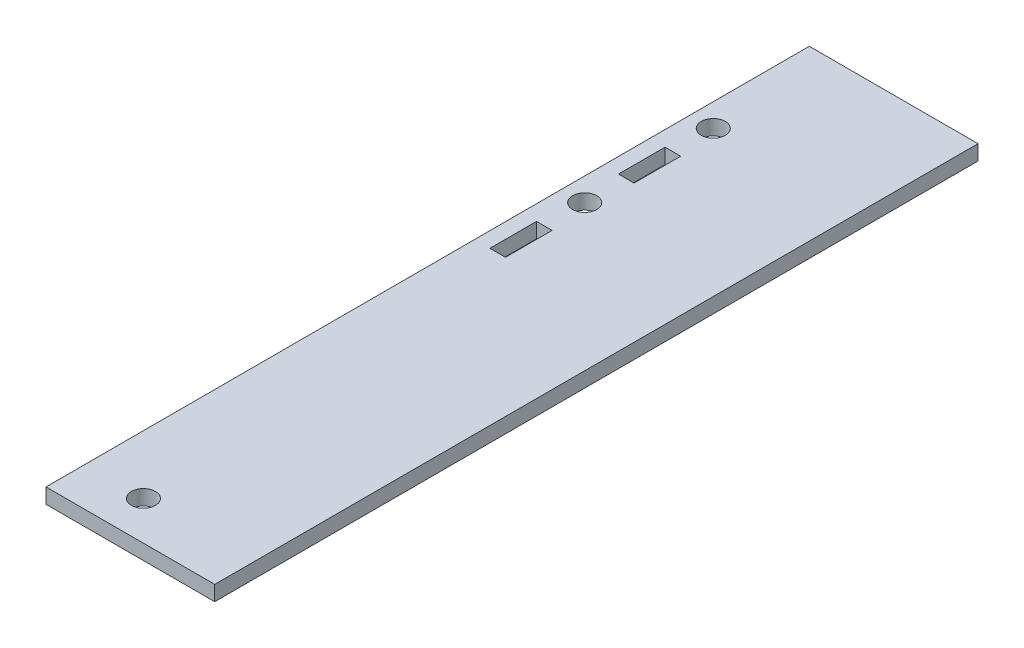
ISO-10303-21;
HEADER;
FILE_DESCRIPTION(('STEP AP214'),'2;1');
FILE_NAME('part.step','',(''),(''),'','','');
FILE_SCHEMA(('AUTOMOTIVE_DESIGN { 1 0 10303 214 1 1 1 1 }'));
ENDSEC;
DATA;
#1=APPLICATION_CONTEXT('core data for automotive mechanical design processes');
#2=APPLICATION_PROTOCOL_DEFINITION('international standard','automotive_design',2000,#1);
#3=PRODUCT_CONTEXT('',#1,'mechanical');
#4=PRODUCT('Part','Part','',(#3));
#5=PRODUCT_RELATED_PRODUCT_CATEGORY('part','',(#4));
#6=PRODUCT_DEFINITION_FORMATION('','',#4);
#7=PRODUCT_DEFINITION_CONTEXT('part definition',#1,'design');
#8=PRODUCT_DEFINITION('design','',#6,#7);
#9=PRODUCT_DEFINITION_SHAPE('','',#8);
#10=(LENGTH_UNIT() NAMED_UNIT(*) SI_UNIT(.MILLI.,.METRE.));
#11=(NAMED_UNIT(*) PLANE_ANGLE_UNIT() SI_UNIT($,.RADIAN.));
#12=(NAMED_UNIT(*) SI_UNIT($,.STERADIAN.) SOLID_ANGLE_UNIT());
#13=UNCERTAINTY_MEASURE_WITH_UNIT(LENGTH_MEASURE(1.E-05),#10,'distance_accuracy_value','');
#14=(GEOMETRIC_REPRESENTATION_CONTEXT(3) GLOBAL_UNCERTAINTY_ASSIGNED_CONTEXT((#13)) GLOBAL_UNIT_ASSIGNED_CONTEXT((#10,
#11,#12)) REPRESENTATION_CONTEXT('',''));
#15=CARTESIAN_POINT('',(0.,0.,0.));
#16=DIRECTION('',(0.,0.,1.));
#17=DIRECTION('',(1.,0.,0.));
#18=AXIS2_PLACEMENT_3D('',#15,#16,#17);
#19=CARTESIAN_POINT('',(19.05,0.,120.65));
#20=DIRECTION('',(0.,1.,0.));
#21=DIRECTION('',(-1.,0.,0.));
#22=AXIS2_PLACEMENT_3D('',#19,#20,#21);
#23=PLANE('',#22);
#24=CARTESIAN_POINT('',(15.08125,0.,18.82775));
#25=DIRECTION('',(0.,1.,0.));
#26=DIRECTION('',(-1.,0.,0.));
#27=AXIS2_PLACEMENT_3D('',#24,#25,#26);
#28=CIRCLE('',#27,1.905);
#29=CARTESIAN_POINT('',(13.17625,0.,18.82775));
#30=VERTEX_POINT('',#29);
#31=EDGE_CURVE('E287',#30,#30,#28,.T.);
#32=ORIENTED_EDGE('',*,*,#31,.T.);
#33=EDGE_LOOP('',(#32));
#34=FACE_BOUND('',#33,.T.);
#35=DIRECTION('',(0.,0.,1.));
#36=VECTOR('',#35,1.);
#37=CARTESIAN_POINT('',(16.317595,0.,120.65));
#38=LINE('',#37,#36);
#39=CARTESIAN_POINT('',(16.317595,0.,45.5295));
#40=VERTEX_POINT('',#39);
#41=CARTESIAN_POINT('',(16.317595,0.,52.8955));
#42=VERTEX_POINT('',#41);
#43=EDGE_CURVE('E268',#40,#42,#38,.T.);
#44=ORIENTED_EDGE('',*,*,#43,.F.);
#45=DIRECTION('',(1.,0.,0.));
#46=VECTOR('',#45,1.);
#47=CARTESIAN_POINT('',(19.05,0.,45.5295));
#48=LINE('',#47,#46);
#49=CARTESIAN_POINT('',(13.844905,0.,45.5295));
#50=VERTEX_POINT('',#49);
#51=EDGE_CURVE('E201',#50,#40,#48,.T.);
#52=ORIENTED_EDGE('',*,*,#51,.F.);
#53=DIRECTION('',(0.,0.,-1.));
#54=VECTOR('',#53,1.);
#55=CARTESIAN_POINT('',(13.844905,0.,120.65));
#56=LINE('',#55,#54);
#57=CARTESIAN_POINT('',(13.844905,0.,52.8955));
#58=VERTEX_POINT('',#57);
#59=EDGE_CURVE('E260',#58,#50,#56,.T.);
#60=ORIENTED_EDGE('',*,*,#59,.F.);
#61=DIRECTION('',(1.,0.,0.));
#62=VECTOR('',#61,1.);
#63=CARTESIAN_POINT('',(19.05,0.,52.8955));
#64=LINE('',#63,#62);
#65=EDGE_CURVE('E264',#58,#42,#64,.T.);
#66=ORIENTED_EDGE('',*,*,#65,.T.);
#67=EDGE_LOOP('',(#44,#52,#60,#66));
#68=FACE_BOUND('',#67,.T.);
#69=CARTESIAN_POINT('',(20.701,0.,114.5159));
#70=DIRECTION('',(0.,1.,0.));
#71=DIRECTION('',(0.,0.,1.));
#72=AXIS2_PLACEMENT_3D('',#69,#70,#71);
#73=CIRCLE('',#72,1.905);
#74=CARTESIAN_POINT('',(20.701,0.,116.4209));
#75=VERTEX_POINT('',#74);
#76=EDGE_CURVE('E168',#75,#75,#73,.T.);
#77=ORIENTED_EDGE('',*,*,#76,.T.);
#78=EDGE_LOOP('',(#77));
#79=FACE_BOUND('',#78,.T.);
#80=DIRECTION('',(0.,0.,-1.));
#81=VECTOR('',#80,1.);
#82=CARTESIAN_POINT('',(11.43,0.,120.65));
#83=LINE('',#82,#81);
#84=CARTESIAN_POINT('',(11.43,0.,120.65));
#85=VERTEX_POINT('',#84);
#86=CARTESIAN_POINT('',(11.43,0.,0.));
#87=VERTEX_POINT('',#86);
#88=EDGE_CURVE('E153',#85,#87,#83,.T.);
#89=ORIENTED_EDGE('',*,*,#88,.T.);
#90=DIRECTION('',(1.,0.,0.));
#91=VECTOR('',#90,1.);
#92=CARTESIAN_POINT('',(11.43,0.,0.));
#93=LINE('',#92,#91);
#94=CARTESIAN_POINT('',(38.1,0.,0.));
#95=VERTEX_POINT('',#94);
#96=EDGE_CURVE('E64',#87,#95,#93,.T.);
#97=ORIENTED_EDGE('',*,*,#96,.T.);
#98=DIRECTION('',(0.,0.,1.));
#99=VECTOR('',#98,1.);
#100=CARTESIAN_POINT('',(38.1,0.,0.));
#101=LINE('',#100,#99);
#102=CARTESIAN_POINT('',(38.1,0.,120.65));
#103=VERTEX_POINT('',#102);
#104=EDGE_CURVE('E151',#95,#103,#101,.T.);
#105=ORIENTED_EDGE('',*,*,#104,.T.);
#106=DIRECTION('',(1.,0.,0.));
#107=VECTOR('',#106,1.);
#108=CARTESIAN_POINT('',(19.05,0.,120.65));
#109=LINE('',#108,#107);
#110=EDGE_CURVE('E57',#85,#103,#109,.T.);
#111=ORIENTED_EDGE('',*,*,#110,.F.);
#112=EDGE_LOOP('',(#89,#97,#105,#111));
#113=FACE_BOUND('',#112,.T.);
#114=CARTESIAN_POINT('',(15.08125,0.,39.14775));
#115=DIRECTION('',(0.,1.,0.));
#116=DIRECTION('',(-1.,0.,0.));
#117=AXIS2_PLACEMENT_3D('',#114,#115,#116);
#118=CIRCLE('',#117,1.905);
#119=CARTESIAN_POINT('',(13.17625,0.,39.14775));
#120=VERTEX_POINT('',#119);
#121=EDGE_CURVE('E271',#120,#120,#118,.T.);
#122=ORIENTED_EDGE('',*,*,#121,.T.);
#123=EDGE_LOOP('',(#122));
#124=FACE_BOUND('',#123,.T.);
#125=DIRECTION('',(0.,0.,1.));
#126=VECTOR('',#125,1.);
#127=CARTESIAN_POINT('',(16.317595,0.,120.65));
#128=LINE('',#127,#126);
#129=CARTESIAN_POINT('',(16.317595,0.,25.2095));
#130=VERTEX_POINT('',#129);
#131=CARTESIAN_POINT('',(16.317595,0.,32.5755));
#132=VERTEX_POINT('',#131);
#133=EDGE_CURVE('E284',#130,#132,#128,.T.);
#134=ORIENTED_EDGE('',*,*,#133,.F.);
#135=DIRECTION('',(1.,0.,0.));
#136=VECTOR('',#135,1.);
#137=CARTESIAN_POINT('',(19.05,0.,25.2095));
#138=LINE('',#137,#136);
#139=CARTESIAN_POINT('',(13.844905,0.,25.2095));
#140=VERTEX_POINT('',#139);
#141=EDGE_CURVE('E275',#140,#130,#138,.T.);
#142=ORIENTED_EDGE('',*,*,#141,.F.);
#143=DIRECTION('',(0.,0.,-1.));
#144=VECTOR('',#143,1.);
#145=CARTESIAN_POINT('',(13.844905,0.,120.65));
#146=LINE('',#145,#144);
#147=CARTESIAN_POINT('',(13.844905,0.,32.5755));
#148=VERTEX_POINT('',#147);
#149=EDGE_CURVE('E278',#148,#140,#146,.T.);
#150=ORIENTED_EDGE('',*,*,#149,.F.);
#151=DIRECTION('',(-1.,0.,0.));
#152=VECTOR('',#151,1.);
#153=CARTESIAN_POINT('',(19.05,0.,32.5755));
#154=LINE('',#153,#152);
#155=EDGE_CURVE('E281',#132,#148,#154,.T.);
#156=ORIENTED_EDGE('',*,*,#155,.F.);
#157=EDGE_LOOP('',(#134,#142,#150,#156));
#158=FACE_BOUND('',#157,.T.);
#159=ADVANCED_FACE('F49',(#34,#68,#79,#113,#124,#158),#23,.F.);
#160=CARTESIAN_POINT('',(0.,2.38125,120.65));
#161=DIRECTION('',(0.,-1.,0.));
#162=DIRECTION('',(0.,0.,-1.));
#163=AXIS2_PLACEMENT_3D('',#160,#161,#162);
#164=PLANE('',#163);
#165=CARTESIAN_POINT('',(15.08125,2.38125,18.82775));
#166=DIRECTION('',(0.,1.,0.));
#167=DIRECTION('',(0.,0.,1.));
#168=AXIS2_PLACEMENT_3D('',#165,#166,#167);
#169=CIRCLE('',#168,1.905);
#170=CARTESIAN_POINT('',(15.08125,2.38125,20.73275));
#171=VERTEX_POINT('',#170);
#172=EDGE_CURVE('E197',#171,#171,#169,.T.);
#173=ORIENTED_EDGE('',*,*,#172,.F.);
#174=EDGE_LOOP('',(#173));
#175=FACE_BOUND('',#174,.T.);
#176=DIRECTION('',(0.,0.,1.));
#177=VECTOR('',#176,1.);
#178=CARTESIAN_POINT('',(16.317595,2.38125,0.));
#179=LINE('',#178,#177);
#180=CARTESIAN_POINT('',(16.317595,2.38125,45.5295));
#181=VERTEX_POINT('',#180);
#182=CARTESIAN_POINT('',(16.317595,2.38125,52.8955));
#183=VERTEX_POINT('',#182);
#184=EDGE_CURVE('E185',#181,#183,#179,.T.);
#185=ORIENTED_EDGE('',*,*,#184,.T.);
#186=DIRECTION('',(1.,0.,0.));
#187=VECTOR('',#186,1.);
#188=CARTESIAN_POINT('',(0.,2.38125,52.8955));
#189=LINE('',#188,#187);
#190=CARTESIAN_POINT('',(13.844905,2.38125,52.8955));
#191=VERTEX_POINT('',#190);
#192=EDGE_CURVE('E242',#191,#183,#189,.T.);
#193=ORIENTED_EDGE('',*,*,#192,.F.);
#194=DIRECTION('',(0.,0.,-1.));
#195=VECTOR('',#194,1.);
#196=CARTESIAN_POINT('',(13.844905,2.38125,0.));
#197=LINE('',#196,#195);
#198=CARTESIAN_POINT('',(13.844905,2.38125,45.5295));
#199=VERTEX_POINT('',#198);
#200=EDGE_CURVE('E238',#191,#199,#197,.T.);
#201=ORIENTED_EDGE('',*,*,#200,.T.);
#202=DIRECTION('',(1.,0.,0.));
#203=VECTOR('',#202,1.);
#204=CARTESIAN_POINT('',(0.,2.38125,45.5295));
#205=LINE('',#204,#203);
#206=EDGE_CURVE('E192',#199,#181,#205,.T.);
#207=ORIENTED_EDGE('',*,*,#206,.T.);
#208=EDGE_LOOP('',(#185,#193,#201,#207));
#209=FACE_BOUND('',#208,.T.);
#210=CARTESIAN_POINT('',(20.701,2.38125,114.5159));
#211=DIRECTION('',(0.,1.,0.));
#212=DIRECTION('',(0.,0.,1.));
#213=AXIS2_PLACEMENT_3D('',#210,#211,#212);
#214=CIRCLE('',#213,1.905);
#215=CARTESIAN_POINT('',(20.701,2.38125,116.4209));
#216=VERTEX_POINT('',#215);
#217=EDGE_CURVE('E171',#216,#216,#214,.T.);
#218=ORIENTED_EDGE('',*,*,#217,.F.);
#219=EDGE_LOOP('',(#218));
#220=FACE_BOUND('',#219,.T.);
#221=DIRECTION('',(0.,0.,1.));
#222=VECTOR('',#221,1.);
#223=CARTESIAN_POINT('',(38.1,2.38125,0.));
#224=LINE('',#223,#222);
#225=CARTESIAN_POINT('',(38.1,2.38125,0.));
#226=VERTEX_POINT('',#225);
#227=CARTESIAN_POINT('',(38.1,2.38125,120.65));
#228=VERTEX_POINT('',#227);
#229=EDGE_CURVE('E161',#226,#228,#224,.T.);
#230=ORIENTED_EDGE('',*,*,#229,.F.);
#231=DIRECTION('',(1.,0.,0.));
#232=VECTOR('',#231,1.);
#233=CARTESIAN_POINT('',(11.43,2.38125,0.));
#234=LINE('',#233,#232);
#235=CARTESIAN_POINT('',(11.43,2.38125,0.));
#236=VERTEX_POINT('',#235);
#237=EDGE_CURVE('E139',#236,#226,#234,.T.);
#238=ORIENTED_EDGE('',*,*,#237,.F.);
#239=DIRECTION('',(0.,0.,-1.));
#240=VECTOR('',#239,1.);
#241=CARTESIAN_POINT('',(11.43,2.38125,120.65));
#242=LINE('',#241,#240);
#243=CARTESIAN_POINT('',(11.43,2.38125,120.65));
#244=VERTEX_POINT('',#243);
#245=EDGE_CURVE('E144',#244,#236,#242,.T.);
#246=ORIENTED_EDGE('',*,*,#245,.F.);
#247=DIRECTION('',(-1.,0.,0.));
#248=VECTOR('',#247,1.);
#249=CARTESIAN_POINT('',(0.,2.38125,120.65));
#250=LINE('',#249,#248);
#251=EDGE_CURVE('E11',#228,#244,#250,.T.);
#252=ORIENTED_EDGE('',*,*,#251,.F.);
#253=EDGE_LOOP('',(#230,#238,#246,#252));
#254=FACE_BOUND('',#253,.T.);
#255=CARTESIAN_POINT('',(15.08125,2.38125,39.14775));
#256=DIRECTION('',(0.,1.,0.));
#257=DIRECTION('',(0.,0.,1.));
#258=AXIS2_PLACEMENT_3D('',#255,#256,#257);
#259=CIRCLE('',#258,1.905);
#260=CARTESIAN_POINT('',(15.08125,2.38125,41.05275));
#261=VERTEX_POINT('',#260);
#262=EDGE_CURVE('E208',#261,#261,#259,.T.);
#263=ORIENTED_EDGE('',*,*,#262,.F.);
#264=EDGE_LOOP('',(#263));
#265=FACE_BOUND('',#264,.T.);
#266=DIRECTION('',(0.,0.,1.));
#267=VECTOR('',#266,1.);
#268=CARTESIAN_POINT('',(16.317595,2.38125,0.));
#269=LINE('',#268,#267);
#270=CARTESIAN_POINT('',(16.317595,2.38125,25.2095));
#271=VERTEX_POINT('',#270);
#272=CARTESIAN_POINT('',(16.317595,2.38125,32.5755));
#273=VERTEX_POINT('',#272);
#274=EDGE_CURVE('E203',#271,#273,#269,.T.);
#275=ORIENTED_EDGE('',*,*,#274,.T.);
#276=DIRECTION('',(-1.,0.,0.));
#277=VECTOR('',#276,1.);
#278=CARTESIAN_POINT('',(0.,2.38125,32.5755));
#279=LINE('',#278,#277);
#280=CARTESIAN_POINT('',(13.844905,2.38125,32.5755));
#281=VERTEX_POINT('',#280);
#282=EDGE_CURVE('E216',#273,#281,#279,.T.);
#283=ORIENTED_EDGE('',*,*,#282,.T.);
#284=DIRECTION('',(0.,0.,-1.));
#285=VECTOR('',#284,1.);
#286=CARTESIAN_POINT('',(13.844905,2.38125,0.));
#287=LINE('',#286,#285);
#288=CARTESIAN_POINT('',(13.844905,2.38125,25.2095));
#289=VERTEX_POINT('',#288);
#290=EDGE_CURVE('E212',#281,#289,#287,.T.);
#291=ORIENTED_EDGE('',*,*,#290,.T.);
#292=DIRECTION('',(1.,0.,0.));
#293=VECTOR('',#292,1.);
#294=CARTESIAN_POINT('',(0.,2.38125,25.2095));
#295=LINE('',#294,#293);
#296=EDGE_CURVE('E207',#289,#271,#295,.T.);
#297=ORIENTED_EDGE('',*,*,#296,.T.);
#298=EDGE_LOOP('',(#275,#283,#291,#297));
#299=FACE_BOUND('',#298,.T.);
#300=ADVANCED_FACE('F304',(#175,#209,#220,#254,#265,#299),#164,.F.);
#301=CARTESIAN_POINT('',(0.,0.,120.65));
#302=DIRECTION('',(0.,0.,-1.));
#303=DIRECTION('',(-1.,0.,0.));
#304=AXIS2_PLACEMENT_3D('',#301,#302,#303);
#305=PLANE('',#304);
#306=ORIENTED_EDGE('',*,*,#251,.T.);
#307=DIRECTION('',(0.,1.,0.));
#308=VECTOR('',#307,1.);
#309=CARTESIAN_POINT('',(11.43,0.,120.65));
#310=LINE('',#309,#308);
#311=EDGE_CURVE('E179',#85,#244,#310,.T.);
#312=ORIENTED_EDGE('',*,*,#311,.F.);
#313=ORIENTED_EDGE('',*,*,#110,.T.);
#314=DIRECTION('',(0.,1.,0.));
#315=VECTOR('',#314,1.);
#316=CARTESIAN_POINT('',(38.1,0.,120.65));
#317=LINE('',#316,#315);
#318=EDGE_CURVE('E159',#103,#228,#317,.T.);
#319=ORIENTED_EDGE('',*,*,#318,.T.);
#320=EDGE_LOOP('',(#306,#312,#313,#319));
#321=FACE_BOUND('',#320,.T.);
#322=ADVANCED_FACE('F178',(#321),#305,.F.);
#323=CARTESIAN_POINT('',(38.1,0.,0.));
#324=DIRECTION('',(-1.,0.,0.));
#325=DIRECTION('',(0.,0.,1.));
#326=AXIS2_PLACEMENT_3D('',#323,#324,#325);
#327=PLANE('',#326);
#328=ORIENTED_EDGE('',*,*,#104,.F.);
#329=DIRECTION('',(0.,1.,0.));
#330=VECTOR('',#329,1.);
#331=CARTESIAN_POINT('',(38.1,0.,0.));
#332=LINE('',#331,#330);
#333=EDGE_CURVE('E136',#95,#226,#332,.T.);
#334=ORIENTED_EDGE('',*,*,#333,.T.);
#335=ORIENTED_EDGE('',*,*,#229,.T.);
#336=ORIENTED_EDGE('',*,*,#318,.F.);
#337=EDGE_LOOP('',(#328,#334,#335,#336));
#338=FACE_BOUND('',#337,.T.);
#339=ADVANCED_FACE('F157',(#338),#327,.F.);
#340=CARTESIAN_POINT('',(20.701,0.,114.5159));
#341=DIRECTION('',(0.,1.,0.));
#342=DIRECTION('',(0.,0.,1.));
#343=AXIS2_PLACEMENT_3D('',#340,#341,#342);
#344=CYLINDRICAL_SURFACE('',#343,1.905);
#345=ORIENTED_EDGE('',*,*,#76,.F.);
#346=EDGE_LOOP('',(#345));
#347=FACE_BOUND('',#346,.T.);
#348=ORIENTED_EDGE('',*,*,#217,.T.);
#349=EDGE_LOOP('',(#348));
#350=FACE_BOUND('',#349,.T.);
#351=ADVANCED_FACE('F302',(#347,#350),#344,.F.);
#352=CARTESIAN_POINT('',(16.317595,-0.15875,0.));
#353=DIRECTION('',(-1.,0.,0.));
#354=DIRECTION('',(0.,0.,1.));
#355=AXIS2_PLACEMENT_3D('',#352,#353,#354);
#356=PLANE('',#355);
#357=ORIENTED_EDGE('',*,*,#43,.T.);
#358=DIRECTION('',(0.,1.,0.));
#359=VECTOR('',#358,1.);
#360=CARTESIAN_POINT('',(16.317595,-0.15875,52.8955));
#361=LINE('',#360,#359);
#362=EDGE_CURVE('E233',#42,#183,#361,.T.);
#363=ORIENTED_EDGE('',*,*,#362,.T.);
#364=ORIENTED_EDGE('',*,*,#184,.F.);
#365=DIRECTION('',(0.,1.,0.));
#366=VECTOR('',#365,1.);
#367=CARTESIAN_POINT('',(16.317595,-0.15875,45.5295));
#368=LINE('',#367,#366);
#369=EDGE_CURVE('E246',#40,#181,#368,.T.);
#370=ORIENTED_EDGE('',*,*,#369,.F.);
#371=EDGE_LOOP('',(#357,#363,#364,#370));
#372=FACE_BOUND('',#371,.T.);
#373=ADVANCED_FACE('F350',(#372),#356,.T.);
#374=CARTESIAN_POINT('',(0.,-0.15875,52.8955));
#375=DIRECTION('',(0.,0.,1.));
#376=DIRECTION('',(1.,0.,0.));
#377=AXIS2_PLACEMENT_3D('',#374,#375,#376);
#378=PLANE('',#377);
#379=DIRECTION('',(0.,1.,0.));
#380=VECTOR('',#379,1.);
#381=CARTESIAN_POINT('',(13.844905,-0.15875,52.8955));
#382=LINE('',#381,#380);
#383=EDGE_CURVE('E249',#58,#191,#382,.T.);
#384=ORIENTED_EDGE('',*,*,#383,.T.);
#385=ORIENTED_EDGE('',*,*,#192,.T.);
#386=ORIENTED_EDGE('',*,*,#362,.F.);
#387=ORIENTED_EDGE('',*,*,#65,.F.);
#388=EDGE_LOOP('',(#384,#385,#386,#387));
#389=FACE_BOUND('',#388,.T.);
#390=ADVANCED_FACE('F352',(#389),#378,.F.);
#391=CARTESIAN_POINT('',(13.844905,-0.15875,0.));
#392=DIRECTION('',(1.,0.,0.));
#393=DIRECTION('',(0.,0.,-1.));
#394=AXIS2_PLACEMENT_3D('',#391,#392,#393);
#395=PLANE('',#394);
#396=ORIENTED_EDGE('',*,*,#59,.T.);
#397=DIRECTION('',(0.,1.,0.));
#398=VECTOR('',#397,1.);
#399=CARTESIAN_POINT('',(13.844905,-0.15875,45.5295));
#400=LINE('',#399,#398);
#401=EDGE_CURVE('E252',#50,#199,#400,.T.);
#402=ORIENTED_EDGE('',*,*,#401,.T.);
#403=ORIENTED_EDGE('',*,*,#200,.F.);
#404=ORIENTED_EDGE('',*,*,#383,.F.);
#405=EDGE_LOOP('',(#396,#402,#403,#404));
#406=FACE_BOUND('',#405,.T.);
#407=ADVANCED_FACE('F361',(#406),#395,.T.);
#408=CARTESIAN_POINT('',(0.,-0.15875,45.5295));
#409=DIRECTION('',(0.,0.,1.));
#410=DIRECTION('',(1.,0.,0.));
#411=AXIS2_PLACEMENT_3D('',#408,#409,#410);
#412=PLANE('',#411);
#413=ORIENTED_EDGE('',*,*,#51,.T.);
#414=ORIENTED_EDGE('',*,*,#369,.T.);
#415=ORIENTED_EDGE('',*,*,#206,.F.);
#416=ORIENTED_EDGE('',*,*,#401,.F.);
#417=EDGE_LOOP('',(#413,#414,#415,#416));
#418=FACE_BOUND('',#417,.T.);
#419=ADVANCED_FACE('F359',(#418),#412,.T.);
#420=CARTESIAN_POINT('',(15.08125,-0.15875,39.14775));
#421=DIRECTION('',(0.,1.,0.));
#422=DIRECTION('',(0.,0.,1.));
#423=AXIS2_PLACEMENT_3D('',#420,#421,#422);
#424=CYLINDRICAL_SURFACE('',#423,1.905);
#425=ORIENTED_EDGE('',*,*,#262,.T.);
#426=EDGE_LOOP('',(#425));
#427=FACE_BOUND('',#426,.T.);
#428=ORIENTED_EDGE('',*,*,#121,.F.);
#429=EDGE_LOOP('',(#428));
#430=FACE_BOUND('',#429,.T.);
#431=ADVANCED_FACE('F368',(#427,#430),#424,.F.);
#432=CARTESIAN_POINT('',(16.317595,-0.15875,0.));
#433=DIRECTION('',(-1.,0.,0.));
#434=DIRECTION('',(0.,0.,1.));
#435=AXIS2_PLACEMENT_3D('',#432,#433,#434);
#436=PLANE('',#435);
#437=ORIENTED_EDGE('',*,*,#133,.T.);
#438=DIRECTION('',(0.,1.,0.));
#439=VECTOR('',#438,1.);
#440=CARTESIAN_POINT('',(16.317595,-0.15875,32.5755));
#441=LINE('',#440,#439);
#442=EDGE_CURVE('E202',#132,#273,#441,.T.);
#443=ORIENTED_EDGE('',*,*,#442,.T.);
#444=ORIENTED_EDGE('',*,*,#274,.F.);
#445=DIRECTION('',(0.,1.,0.));
#446=VECTOR('',#445,1.);
#447=CARTESIAN_POINT('',(16.317595,-0.15875,25.2095));
#448=LINE('',#447,#446);
#449=EDGE_CURVE('E220',#130,#271,#448,.T.);
#450=ORIENTED_EDGE('',*,*,#449,.F.);
#451=EDGE_LOOP('',(#437,#443,#444,#450));
#452=FACE_BOUND('',#451,.T.);
#453=ADVANCED_FACE('F314',(#452),#436,.T.);
#454=CARTESIAN_POINT('',(0.,-0.15875,32.5755));
#455=DIRECTION('',(0.,0.,-1.));
#456=DIRECTION('',(-1.,0.,0.));
#457=AXIS2_PLACEMENT_3D('',#454,#455,#456);
#458=PLANE('',#457);
#459=ORIENTED_EDGE('',*,*,#155,.T.);
#460=DIRECTION('',(0.,1.,0.));
#461=VECTOR('',#460,1.);
#462=CARTESIAN_POINT('',(13.844905,-0.15875,32.5755));
#463=LINE('',#462,#461);
#464=EDGE_CURVE('E223',#148,#281,#463,.T.);
#465=ORIENTED_EDGE('',*,*,#464,.T.);
#466=ORIENTED_EDGE('',*,*,#282,.F.);
#467=ORIENTED_EDGE('',*,*,#442,.F.);
#468=EDGE_LOOP('',(#459,#465,#466,#467));
#469=FACE_BOUND('',#468,.T.);
#470=ADVANCED_FACE('F323',(#469),#458,.T.);
#471=CARTESIAN_POINT('',(13.844905,-0.15875,0.));
#472=DIRECTION('',(1.,0.,0.));
#473=DIRECTION('',(0.,0.,-1.));
#474=AXIS2_PLACEMENT_3D('',#471,#472,#473);
#475=PLANE('',#474);
#476=ORIENTED_EDGE('',*,*,#149,.T.);
#477=DIRECTION('',(0.,1.,0.));
#478=VECTOR('',#477,1.);
#479=CARTESIAN_POINT('',(13.844905,-0.15875,25.2095));
#480=LINE('',#479,#478);
#481=EDGE_CURVE('E72',#140,#289,#480,.T.);
#482=ORIENTED_EDGE('',*,*,#481,.T.);
#483=ORIENTED_EDGE('',*,*,#290,.F.);
#484=ORIENTED_EDGE('',*,*,#464,.F.);
#485=EDGE_LOOP('',(#476,#482,#483,#484));
#486=FACE_BOUND('',#485,.T.);
#487=ADVANCED_FACE('F327',(#486),#475,.T.);
#488=CARTESIAN_POINT('',(0.,-0.15875,25.2095));
#489=DIRECTION('',(0.,0.,1.));
#490=DIRECTION('',(1.,0.,0.));
#491=AXIS2_PLACEMENT_3D('',#488,#489,#490);
#492=PLANE('',#491);
#493=ORIENTED_EDGE('',*,*,#141,.T.);
#494=ORIENTED_EDGE('',*,*,#449,.T.);
#495=ORIENTED_EDGE('',*,*,#296,.F.);
#496=ORIENTED_EDGE('',*,*,#481,.F.);
#497=EDGE_LOOP('',(#493,#494,#495,#496));
#498=FACE_BOUND('',#497,.T.);
#499=ADVANCED_FACE('F317',(#498),#492,.T.);
#500=CARTESIAN_POINT('',(15.08125,-0.15875,18.82775));
#501=DIRECTION('',(0.,1.,0.));
#502=DIRECTION('',(0.,0.,1.));
#503=AXIS2_PLACEMENT_3D('',#500,#501,#502);
#504=CYLINDRICAL_SURFACE('',#503,1.905);
#505=ORIENTED_EDGE('',*,*,#172,.T.);
#506=EDGE_LOOP('',(#505));
#507=FACE_BOUND('',#506,.T.);
#508=ORIENTED_EDGE('',*,*,#31,.F.);
#509=EDGE_LOOP('',(#508));
#510=FACE_BOUND('',#509,.T.);
#511=ADVANCED_FACE('F334',(#507,#510),#504,.F.);
#512=CARTESIAN_POINT('',(11.43,0.,120.65));
#513=DIRECTION('',(1.,0.,0.));
#514=DIRECTION('',(0.,0.,-1.));
#515=AXIS2_PLACEMENT_3D('',#512,#513,#514);
#516=PLANE('',#515);
#517=ORIENTED_EDGE('',*,*,#245,.T.);
#518=DIRECTION('',(0.,1.,0.));
#519=VECTOR('',#518,1.);
#520=CARTESIAN_POINT('',(11.43,0.,0.));
#521=LINE('',#520,#519);
#522=EDGE_CURVE('E145',#87,#236,#521,.T.);
#523=ORIENTED_EDGE('',*,*,#522,.F.);
#524=ORIENTED_EDGE('',*,*,#88,.F.);
#525=ORIENTED_EDGE('',*,*,#311,.T.);
#526=EDGE_LOOP('',(#517,#523,#524,#525));
#527=FACE_BOUND('',#526,.T.);
#528=ADVANCED_FACE('F389',(#527),#516,.F.);
#529=CARTESIAN_POINT('',(11.43,0.,0.));
#530=DIRECTION('',(0.,0.,1.));
#531=DIRECTION('',(1.,0.,0.));
#532=AXIS2_PLACEMENT_3D('',#529,#530,#531);
#533=PLANE('',#532);
#534=ORIENTED_EDGE('',*,*,#237,.T.);
#535=ORIENTED_EDGE('',*,*,#333,.F.);
#536=ORIENTED_EDGE('',*,*,#96,.F.);
#537=ORIENTED_EDGE('',*,*,#522,.T.);
#538=EDGE_LOOP('',(#534,#535,#536,#537));
#539=FACE_BOUND('',#538,.T.);
#540=ADVANCED_FACE('F137',(#539),#533,.F.);
#541=CLOSED_SHELL('',(#159,#300,#322,#339,#351,#373,#390,#407,#419,#431,#453,#470,#487,#499,
#511,#528,#540));
#542=MANIFOLD_SOLID_BREP('B2',#541);
#543=ADVANCED_BREP_SHAPE_REPRESENTATION('',(#18,#542),#14);
#544=SHAPE_DEFINITION_REPRESENTATION(#9,#543);
ENDSEC;
END-ISO-10303-21;
